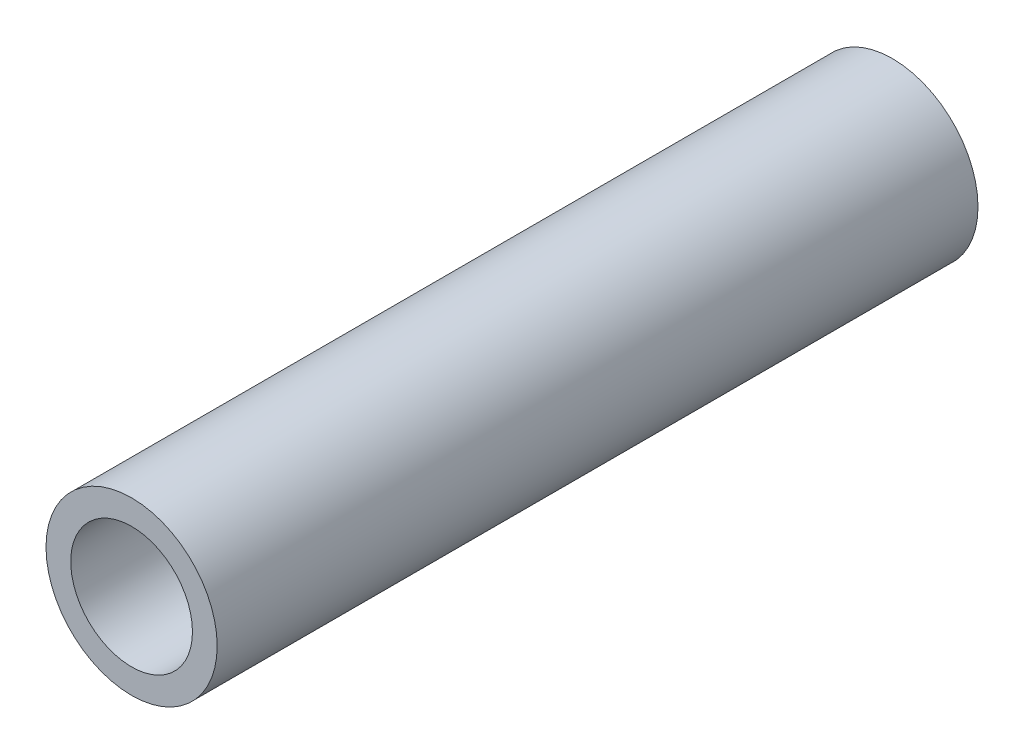
ISO-10303-21;
HEADER;
FILE_DESCRIPTION(('STEP AP214'),'2;1');
FILE_NAME('part.step','',(''),(''),'','','');
FILE_SCHEMA(('AUTOMOTIVE_DESIGN { 1 0 10303 214 1 1 1 1 }'));
ENDSEC;
DATA;
#1=APPLICATION_CONTEXT('core data for automotive mechanical design processes');
#2=APPLICATION_PROTOCOL_DEFINITION('international standard','automotive_design',2000,#1);
#3=PRODUCT_CONTEXT('',#1,'mechanical');
#4=PRODUCT('Part','Part','',(#3));
#5=PRODUCT_RELATED_PRODUCT_CATEGORY('part','',(#4));
#6=PRODUCT_DEFINITION_FORMATION('','',#4);
#7=PRODUCT_DEFINITION_CONTEXT('part definition',#1,'design');
#8=PRODUCT_DEFINITION('design','',#6,#7);
#9=PRODUCT_DEFINITION_SHAPE('','',#8);
#10=(LENGTH_UNIT() NAMED_UNIT(*) SI_UNIT(.MILLI.,.METRE.));
#11=(NAMED_UNIT(*) PLANE_ANGLE_UNIT() SI_UNIT($,.RADIAN.));
#12=(NAMED_UNIT(*) SI_UNIT($,.STERADIAN.) SOLID_ANGLE_UNIT());
#13=UNCERTAINTY_MEASURE_WITH_UNIT(LENGTH_MEASURE(1.E-05),#10,'distance_accuracy_value','');
#14=(GEOMETRIC_REPRESENTATION_CONTEXT(3) GLOBAL_UNCERTAINTY_ASSIGNED_CONTEXT((#13)) GLOBAL_UNIT_ASSIGNED_CONTEXT((#10,
#11,#12)) REPRESENTATION_CONTEXT('',''));
#15=CARTESIAN_POINT('',(0.,0.,0.));
#16=DIRECTION('',(0.,0.,1.));
#17=DIRECTION('',(1.,0.,0.));
#18=AXIS2_PLACEMENT_3D('',#15,#16,#17);
#19=CARTESIAN_POINT('',(0.,0.,10.));
#20=DIRECTION('',(0.,0.,1.));
#21=DIRECTION('',(1.,0.,0.));
#22=AXIS2_PLACEMENT_3D('',#19,#20,#21);
#23=PLANE('',#22);
#24=CARTESIAN_POINT('',(0.,0.,10.));
#25=DIRECTION('',(0.,0.,1.));
#26=DIRECTION('',(1.,0.,0.));
#27=AXIS2_PLACEMENT_3D('',#24,#25,#26);
#28=CIRCLE('',#27,2.25);
#29=CARTESIAN_POINT('',(2.25,0.,10.));
#30=VERTEX_POINT('',#29);
#31=EDGE_CURVE('E10',#30,#30,#28,.T.);
#32=ORIENTED_EDGE('',*,*,#31,.T.);
#33=EDGE_LOOP('',(#32));
#34=FACE_BOUND('',#33,.T.);
#35=CARTESIAN_POINT('',(0.,0.,10.));
#36=DIRECTION('',(0.,0.,1.));
#37=DIRECTION('',(1.,0.,0.));
#38=AXIS2_PLACEMENT_3D('',#35,#36,#37);
#39=CIRCLE('',#38,1.6);
#40=CARTESIAN_POINT('',(1.6,0.,10.));
#41=VERTEX_POINT('',#40);
#42=EDGE_CURVE('E41',#41,#41,#39,.T.);
#43=ORIENTED_EDGE('',*,*,#42,.F.);
#44=EDGE_LOOP('',(#43));
#45=FACE_BOUND('',#44,.T.);
#46=ADVANCED_FACE('F30',(#34,#45),#23,.T.);
#47=CARTESIAN_POINT('',(0.,0.,-10.));
#48=DIRECTION('',(0.,0.,1.));
#49=DIRECTION('',(1.,0.,0.));
#50=AXIS2_PLACEMENT_3D('',#47,#48,#49);
#51=PLANE('',#50);
#52=CARTESIAN_POINT('',(0.,0.,-10.));
#53=DIRECTION('',(0.,0.,1.));
#54=DIRECTION('',(1.,0.,0.));
#55=AXIS2_PLACEMENT_3D('',#52,#53,#54);
#56=CIRCLE('',#55,2.25);
#57=CARTESIAN_POINT('',(2.25,0.,-10.));
#58=VERTEX_POINT('',#57);
#59=EDGE_CURVE('E34',#58,#58,#56,.T.);
#60=ORIENTED_EDGE('',*,*,#59,.F.);
#61=EDGE_LOOP('',(#60));
#62=FACE_BOUND('',#61,.T.);
#63=CARTESIAN_POINT('',(0.,0.,-10.));
#64=DIRECTION('',(0.,0.,1.));
#65=DIRECTION('',(1.,0.,0.));
#66=AXIS2_PLACEMENT_3D('',#63,#64,#65);
#67=CIRCLE('',#66,1.6);
#68=CARTESIAN_POINT('',(1.6,0.,-10.));
#69=VERTEX_POINT('',#68);
#70=EDGE_CURVE('E43',#69,#69,#67,.T.);
#71=ORIENTED_EDGE('',*,*,#70,.T.);
#72=EDGE_LOOP('',(#71));
#73=FACE_BOUND('',#72,.T.);
#74=ADVANCED_FACE('F53',(#62,#73),#51,.F.);
#75=CARTESIAN_POINT('',(0.,0.,10.));
#76=DIRECTION('',(0.,0.,-1.));
#77=DIRECTION('',(-1.,0.,0.));
#78=AXIS2_PLACEMENT_3D('',#75,#76,#77);
#79=CYLINDRICAL_SURFACE('',#78,2.25);
#80=ORIENTED_EDGE('',*,*,#31,.F.);
#81=EDGE_LOOP('',(#80));
#82=FACE_BOUND('',#81,.T.);
#83=ORIENTED_EDGE('',*,*,#59,.T.);
#84=EDGE_LOOP('',(#83));
#85=FACE_BOUND('',#84,.T.);
#86=ADVANCED_FACE('F32',(#82,#85),#79,.T.);
#87=CARTESIAN_POINT('',(0.,0.,10.));
#88=DIRECTION('',(0.,0.,-1.));
#89=DIRECTION('',(-1.,0.,0.));
#90=AXIS2_PLACEMENT_3D('',#87,#88,#89);
#91=CYLINDRICAL_SURFACE('',#90,1.6);
#92=ORIENTED_EDGE('',*,*,#42,.T.);
#93=EDGE_LOOP('',(#92));
#94=FACE_BOUND('',#93,.T.);
#95=ORIENTED_EDGE('',*,*,#70,.F.);
#96=EDGE_LOOP('',(#95));
#97=FACE_BOUND('',#96,.T.);
#98=ADVANCED_FACE('F49',(#94,#97),#91,.F.);
#99=CLOSED_SHELL('',(#46,#74,#86,#98));
#100=MANIFOLD_SOLID_BREP('B2',#99);
#101=ADVANCED_BREP_SHAPE_REPRESENTATION('',(#18,#100),#14);
#102=SHAPE_DEFINITION_REPRESENTATION(#9,#101);
ENDSEC;
END-ISO-10303-21;
